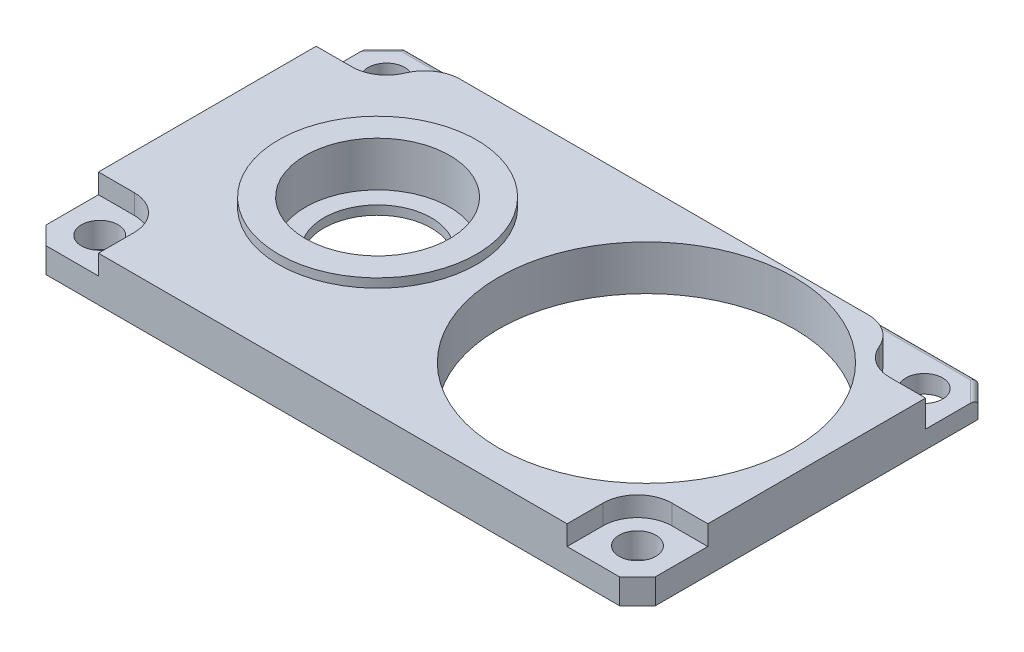
ISO-10303-21;
HEADER;
FILE_DESCRIPTION(('STEP AP214'),'2;1');
FILE_NAME('part.step','',(''),(''),'','','');
FILE_SCHEMA(('AUTOMOTIVE_DESIGN { 1 0 10303 214 1 1 1 1 }'));
ENDSEC;
DATA;
#1=APPLICATION_CONTEXT('core data for automotive mechanical design processes');
#2=APPLICATION_PROTOCOL_DEFINITION('international standard','automotive_design',2000,#1);
#3=PRODUCT_CONTEXT('',#1,'mechanical');
#4=PRODUCT('Part','Part','',(#3));
#5=PRODUCT_RELATED_PRODUCT_CATEGORY('part','',(#4));
#6=PRODUCT_DEFINITION_FORMATION('','',#4);
#7=PRODUCT_DEFINITION_CONTEXT('part definition',#1,'design');
#8=PRODUCT_DEFINITION('design','',#6,#7);
#9=PRODUCT_DEFINITION_SHAPE('','',#8);
#10=(LENGTH_UNIT() NAMED_UNIT(*) SI_UNIT(.MILLI.,.METRE.));
#11=(NAMED_UNIT(*) PLANE_ANGLE_UNIT() SI_UNIT($,.RADIAN.));
#12=(NAMED_UNIT(*) SI_UNIT($,.STERADIAN.) SOLID_ANGLE_UNIT());
#13=UNCERTAINTY_MEASURE_WITH_UNIT(LENGTH_MEASURE(1.E-05),#10,'distance_accuracy_value','');
#14=(GEOMETRIC_REPRESENTATION_CONTEXT(3) GLOBAL_UNCERTAINTY_ASSIGNED_CONTEXT((#13)) GLOBAL_UNIT_ASSIGNED_CONTEXT((#10,
#11,#12)) REPRESENTATION_CONTEXT('',''));
#15=CARTESIAN_POINT('',(0.,0.,0.));
#16=DIRECTION('',(0.,0.,1.));
#17=DIRECTION('',(1.,0.,0.));
#18=AXIS2_PLACEMENT_3D('',#15,#16,#17);
#19=CARTESIAN_POINT('',(15.,1.,8.));
#20=DIRECTION('',(0.,1.,0.));
#21=DIRECTION('',(0.,0.,1.));
#22=AXIS2_PLACEMENT_3D('',#19,#20,#21);
#23=CYLINDRICAL_SURFACE('',#22,1.925);
#24=DIRECTION('',(0.,1.,0.));
#25=VECTOR('',#24,1.);
#26=CARTESIAN_POINT('',(13.075,-4.5507882323144,8.));
#27=LINE('',#26,#25);
#28=CARTESIAN_POINT('',(13.075,1.4,8.));
#29=VERTEX_POINT('',#28);
#30=CARTESIAN_POINT('',(13.075,2.5,8.));
#31=VERTEX_POINT('',#30);
#32=EDGE_CURVE('E260',#29,#31,#27,.T.);
#33=ORIENTED_EDGE('',*,*,#32,.F.);
#34=CARTESIAN_POINT('',(15.,1.4,8.));
#35=DIRECTION('',(0.,1.,0.));
#36=DIRECTION('',(0.,0.,1.));
#37=AXIS2_PLACEMENT_3D('',#34,#35,#36);
#38=CIRCLE('',#37,1.92499999999999);
#39=CARTESIAN_POINT('',(15.,1.4,6.07500000000001));
#40=VERTEX_POINT('',#39);
#41=EDGE_CURVE('E547',#40,#29,#38,.T.);
#42=ORIENTED_EDGE('',*,*,#41,.F.);
#43=DIRECTION('',(0.,1.,0.));
#44=VECTOR('',#43,1.);
#45=CARTESIAN_POINT('',(15.,-4.5507882323144,6.07500000000001));
#46=LINE('',#45,#44);
#47=CARTESIAN_POINT('',(15.,2.5,6.07500000000001));
#48=VERTEX_POINT('',#47);
#49=EDGE_CURVE('E261',#40,#48,#46,.T.);
#50=ORIENTED_EDGE('',*,*,#49,.T.);
#51=CARTESIAN_POINT('',(15.,2.5,8.));
#52=DIRECTION('',(0.,1.,0.));
#53=DIRECTION('',(0.,0.,1.));
#54=AXIS2_PLACEMENT_3D('',#51,#52,#53);
#55=CIRCLE('',#54,1.925);
#56=EDGE_CURVE('E305',#48,#31,#55,.T.);
#57=ORIENTED_EDGE('',*,*,#56,.T.);
#58=EDGE_LOOP('',(#33,#42,#50,#57));
#59=FACE_BOUND('',#58,.T.);
#60=ADVANCED_FACE('F47',(#59),#23,.F.);
#61=CARTESIAN_POINT('',(-15.,1.,8.));
#62=DIRECTION('',(0.,1.,0.));
#63=DIRECTION('',(0.,0.,1.));
#64=AXIS2_PLACEMENT_3D('',#61,#62,#63);
#65=CYLINDRICAL_SURFACE('',#64,1.925);
#66=DIRECTION('',(0.,1.,0.));
#67=VECTOR('',#66,1.);
#68=CARTESIAN_POINT('',(-15.,-4.5507882323144,6.075));
#69=LINE('',#68,#67);
#70=CARTESIAN_POINT('',(-15.,1.4,6.075));
#71=VERTEX_POINT('',#70);
#72=CARTESIAN_POINT('',(-15.,2.5,6.075));
#73=VERTEX_POINT('',#72);
#74=EDGE_CURVE('E236',#71,#73,#69,.T.);
#75=ORIENTED_EDGE('',*,*,#74,.F.);
#76=CARTESIAN_POINT('',(-15.,1.4,8.));
#77=DIRECTION('',(0.,1.,0.));
#78=DIRECTION('',(0.,0.,1.));
#79=AXIS2_PLACEMENT_3D('',#76,#77,#78);
#80=CIRCLE('',#79,1.925);
#81=CARTESIAN_POINT('',(-13.075,1.4,8.00000000000001));
#82=VERTEX_POINT('',#81);
#83=EDGE_CURVE('E220',#82,#71,#80,.T.);
#84=ORIENTED_EDGE('',*,*,#83,.F.);
#85=DIRECTION('',(0.,1.,0.));
#86=VECTOR('',#85,1.);
#87=CARTESIAN_POINT('',(-13.075,-4.5507882323144,8.00000000000001));
#88=LINE('',#87,#86);
#89=CARTESIAN_POINT('',(-13.075,2.5,8.00000000000001));
#90=VERTEX_POINT('',#89);
#91=EDGE_CURVE('E272',#82,#90,#88,.T.);
#92=ORIENTED_EDGE('',*,*,#91,.T.);
#93=CARTESIAN_POINT('',(-15.,2.5,8.));
#94=DIRECTION('',(0.,1.,0.));
#95=DIRECTION('',(0.,0.,1.));
#96=AXIS2_PLACEMENT_3D('',#93,#94,#95);
#97=CIRCLE('',#96,1.925);
#98=EDGE_CURVE('E243',#90,#73,#97,.T.);
#99=ORIENTED_EDGE('',*,*,#98,.T.);
#100=EDGE_LOOP('',(#75,#84,#92,#99));
#101=FACE_BOUND('',#100,.T.);
#102=ADVANCED_FACE('F241',(#101),#65,.F.);
#103=CARTESIAN_POINT('',(17.,2.5,8.99999999999999));
#104=DIRECTION('',(-0.707106781186546,0.,-0.707106781186549));
#105=DIRECTION('',(0.,-1.,0.));
#106=AXIS2_PLACEMENT_3D('',#103,#104,#105);
#107=PLANE('',#106);
#108=DIRECTION('',(0.,-1.,0.));
#109=VECTOR('',#108,1.);
#110=CARTESIAN_POINT('',(17.,2.5,8.99999999999999));
#111=LINE('',#110,#109);
#112=CARTESIAN_POINT('',(17.,1.4,9.));
#113=VERTEX_POINT('',#112);
#114=CARTESIAN_POINT('',(17.,0.,8.99999999999999));
#115=VERTEX_POINT('',#114);
#116=EDGE_CURVE('E400',#113,#115,#111,.T.);
#117=ORIENTED_EDGE('',*,*,#116,.F.);
#118=DIRECTION('',(0.707106781186549,0.,-0.707106781186546));
#119=VECTOR('',#118,1.);
#120=CARTESIAN_POINT('',(16.,1.4,10.));
#121=LINE('',#120,#119);
#122=CARTESIAN_POINT('',(16.,1.4,10.));
#123=VERTEX_POINT('',#122);
#124=EDGE_CURVE('E529',#123,#113,#121,.T.);
#125=ORIENTED_EDGE('',*,*,#124,.F.);
#126=DIRECTION('',(0.,1.,0.));
#127=VECTOR('',#126,1.);
#128=CARTESIAN_POINT('',(16.,2.5,10.));
#129=LINE('',#128,#127);
#130=CARTESIAN_POINT('',(16.,0.,10.));
#131=VERTEX_POINT('',#130);
#132=EDGE_CURVE('E412',#131,#123,#129,.T.);
#133=ORIENTED_EDGE('',*,*,#132,.F.);
#134=DIRECTION('',(0.707106781186549,0.,-0.707106781186546));
#135=VECTOR('',#134,1.);
#136=CARTESIAN_POINT('',(17.,0.,8.99999999999999));
#137=LINE('',#136,#135);
#138=EDGE_CURVE('E408',#115,#131,#137,.F.);
#139=ORIENTED_EDGE('',*,*,#138,.F.);
#140=EDGE_LOOP('',(#117,#125,#133,#139));
#141=FACE_BOUND('',#140,.T.);
#142=ADVANCED_FACE('F562',(#141),#107,.F.);
#143=CARTESIAN_POINT('',(-16.,2.5,10.));
#144=DIRECTION('',(0.707106781186549,0.,-0.707106781186546));
#145=DIRECTION('',(0.,-1.,0.));
#146=AXIS2_PLACEMENT_3D('',#143,#144,#145);
#147=PLANE('',#146);
#148=DIRECTION('',(0.,-1.,0.));
#149=VECTOR('',#148,1.);
#150=CARTESIAN_POINT('',(-16.,2.5,10.));
#151=LINE('',#150,#149);
#152=CARTESIAN_POINT('',(-16.,1.4,10.));
#153=VERTEX_POINT('',#152);
#154=CARTESIAN_POINT('',(-16.,0.,10.));
#155=VERTEX_POINT('',#154);
#156=EDGE_CURVE('E410',#153,#155,#151,.T.);
#157=ORIENTED_EDGE('',*,*,#156,.F.);
#158=DIRECTION('',(0.707106781186546,0.,0.707106781186549));
#159=VECTOR('',#158,1.);
#160=CARTESIAN_POINT('',(-17.,1.4,8.99999999999999));
#161=LINE('',#160,#159);
#162=CARTESIAN_POINT('',(-17.,1.4,8.99999999999999));
#163=VERTEX_POINT('',#162);
#164=EDGE_CURVE('E569',#163,#153,#161,.T.);
#165=ORIENTED_EDGE('',*,*,#164,.F.);
#166=DIRECTION('',(0.,1.,0.));
#167=VECTOR('',#166,1.);
#168=CARTESIAN_POINT('',(-17.,2.5,8.99999999999999));
#169=LINE('',#168,#167);
#170=CARTESIAN_POINT('',(-17.,0.,8.99999999999999));
#171=VERTEX_POINT('',#170);
#172=EDGE_CURVE('E416',#171,#163,#169,.T.);
#173=ORIENTED_EDGE('',*,*,#172,.F.);
#174=DIRECTION('',(0.707106781186546,0.,0.707106781186549));
#175=VECTOR('',#174,1.);
#176=CARTESIAN_POINT('',(-16.,0.,10.));
#177=LINE('',#176,#175);
#178=EDGE_CURVE('E406',#155,#171,#177,.F.);
#179=ORIENTED_EDGE('',*,*,#178,.F.);
#180=EDGE_LOOP('',(#157,#165,#173,#179));
#181=FACE_BOUND('',#180,.T.);
#182=ADVANCED_FACE('F567',(#181),#147,.F.);
#183=CARTESIAN_POINT('',(0.,2.5,0.));
#184=DIRECTION('',(0.,1.,0.));
#185=DIRECTION('',(0.,0.,1.));
#186=AXIS2_PLACEMENT_3D('',#183,#184,#185);
#187=PLANE('',#186);
#188=DIRECTION('',(0.,0.,-1.));
#189=VECTOR('',#188,1.);
#190=CARTESIAN_POINT('',(-13.075,2.5,10.));
#191=LINE('',#190,#189);
#192=CARTESIAN_POINT('',(-13.075,2.5,10.));
#193=VERTEX_POINT('',#192);
#194=EDGE_CURVE('E244',#193,#90,#191,.T.);
#195=ORIENTED_EDGE('',*,*,#194,.F.);
#196=DIRECTION('',(1.,0.,0.));
#197=VECTOR('',#196,1.);
#198=CARTESIAN_POINT('',(-17.,2.5,10.));
#199=LINE('',#198,#197);
#200=CARTESIAN_POINT('',(13.075,2.5,9.99999999999999));
#201=VERTEX_POINT('',#200);
#202=EDGE_CURVE('E342',#193,#201,#199,.T.);
#203=ORIENTED_EDGE('',*,*,#202,.T.);
#204=DIRECTION('',(0.,0.,1.));
#205=VECTOR('',#204,1.);
#206=CARTESIAN_POINT('',(13.075,2.5,9.99999999999999));
#207=LINE('',#206,#205);
#208=EDGE_CURVE('E253',#31,#201,#207,.T.);
#209=ORIENTED_EDGE('',*,*,#208,.F.);
#210=ORIENTED_EDGE('',*,*,#56,.F.);
#211=DIRECTION('',(-1.,0.,0.));
#212=VECTOR('',#211,1.);
#213=CARTESIAN_POINT('',(15.,2.5,6.07500000000001));
#214=LINE('',#213,#212);
#215=CARTESIAN_POINT('',(17.,2.5,6.07500000000002));
#216=VERTEX_POINT('',#215);
#217=EDGE_CURVE('E256',#216,#48,#214,.T.);
#218=ORIENTED_EDGE('',*,*,#217,.F.);
#219=DIRECTION('',(0.,0.,-1.));
#220=VECTOR('',#219,1.);
#221=CARTESIAN_POINT('',(17.,2.5,-10.));
#222=LINE('',#221,#220);
#223=CARTESIAN_POINT('',(17.,2.5,-6.075));
#224=VERTEX_POINT('',#223);
#225=EDGE_CURVE('E336',#216,#224,#222,.T.);
#226=ORIENTED_EDGE('',*,*,#225,.T.);
#227=DIRECTION('',(1.,0.,0.));
#228=VECTOR('',#227,1.);
#229=CARTESIAN_POINT('',(15.,2.5,-6.075));
#230=LINE('',#229,#228);
#231=CARTESIAN_POINT('',(15.,2.5,-6.075));
#232=VERTEX_POINT('',#231);
#233=EDGE_CURVE('E282',#232,#224,#230,.T.);
#234=ORIENTED_EDGE('',*,*,#233,.F.);
#235=CARTESIAN_POINT('',(15.,2.5,-8.));
#236=DIRECTION('',(0.,1.,0.));
#237=DIRECTION('',(0.,0.,1.));
#238=AXIS2_PLACEMENT_3D('',#235,#236,#237);
#239=CIRCLE('',#238,1.925);
#240=CARTESIAN_POINT('',(13.2211193317985,2.5,-7.26433121019109));
#241=VERTEX_POINT('',#240);
#242=EDGE_CURVE('E315',#241,#232,#239,.T.);
#243=ORIENTED_EDGE('',*,*,#242,.F.);
#244=CARTESIAN_POINT('',(11.3729316245761,2.5,-6.5));
#245=DIRECTION('',(0.,1.,0.));
#246=DIRECTION('',(0.,0.,1.));
#247=AXIS2_PLACEMENT_3D('',#244,#245,#246);
#248=CIRCLE('',#247,2.);
#249=CARTESIAN_POINT('',(11.3729316245761,2.5,-8.5));
#250=VERTEX_POINT('',#249);
#251=EDGE_CURVE('E384',#241,#250,#248,.T.);
#252=ORIENTED_EDGE('',*,*,#251,.T.);
#253=DIRECTION('',(1.,0.,0.));
#254=VECTOR('',#253,1.);
#255=CARTESIAN_POINT('',(13.1410688554979,2.5,-8.5));
#256=LINE('',#255,#254);
#257=CARTESIAN_POINT('',(-11.3729316245761,2.5,-8.5));
#258=VERTEX_POINT('',#257);
#259=EDGE_CURVE('E297',#258,#250,#256,.T.);
#260=ORIENTED_EDGE('',*,*,#259,.F.);
#261=CARTESIAN_POINT('',(-11.3729316245761,2.5,-6.5));
#262=DIRECTION('',(0.,1.,0.));
#263=DIRECTION('',(0.,0.,1.));
#264=AXIS2_PLACEMENT_3D('',#261,#262,#263);
#265=CIRCLE('',#264,2.);
#266=CARTESIAN_POINT('',(-13.2211193317985,2.5,-7.26433121019108));
#267=VERTEX_POINT('',#266);
#268=EDGE_CURVE('E386',#258,#267,#265,.T.);
#269=ORIENTED_EDGE('',*,*,#268,.T.);
#270=CARTESIAN_POINT('',(-15.,2.5,-8.));
#271=DIRECTION('',(0.,1.,0.));
#272=DIRECTION('',(0.,0.,1.));
#273=AXIS2_PLACEMENT_3D('',#270,#271,#272);
#274=CIRCLE('',#273,1.925);
#275=CARTESIAN_POINT('',(-15.,2.5,-6.075));
#276=VERTEX_POINT('',#275);
#277=EDGE_CURVE('E317',#276,#267,#274,.T.);
#278=ORIENTED_EDGE('',*,*,#277,.F.);
#279=DIRECTION('',(1.,0.,0.));
#280=VECTOR('',#279,1.);
#281=CARTESIAN_POINT('',(-15.,2.5,-6.075));
#282=LINE('',#281,#280);
#283=CARTESIAN_POINT('',(-17.,2.5,-6.075));
#284=VERTEX_POINT('',#283);
#285=EDGE_CURVE('E295',#284,#276,#282,.T.);
#286=ORIENTED_EDGE('',*,*,#285,.F.);
#287=DIRECTION('',(0.,0.,1.));
#288=VECTOR('',#287,1.);
#289=CARTESIAN_POINT('',(-17.,2.5,-10.));
#290=LINE('',#289,#288);
#291=CARTESIAN_POINT('',(-17.,2.5,6.075));
#292=VERTEX_POINT('',#291);
#293=EDGE_CURVE('E338',#284,#292,#290,.T.);
#294=ORIENTED_EDGE('',*,*,#293,.T.);
#295=DIRECTION('',(-1.,0.,0.));
#296=VECTOR('',#295,1.);
#297=CARTESIAN_POINT('',(-15.,2.5,6.075));
#298=LINE('',#297,#296);
#299=EDGE_CURVE('E249',#73,#292,#298,.T.);
#300=ORIENTED_EDGE('',*,*,#299,.F.);
#301=ORIENTED_EDGE('',*,*,#98,.F.);
#302=EDGE_LOOP('',(#195,#203,#209,#210,#218,#226,#234,#243,#252,#260,#269,#278,#286,#294,#300,#301));
#303=FACE_BOUND('',#302,.T.);
#304=CARTESIAN_POINT('',(7.5,2.5,0.));
#305=DIRECTION('',(0.,1.,0.));
#306=DIRECTION('',(0.,0.,1.));
#307=AXIS2_PLACEMENT_3D('',#304,#305,#306);
#308=CIRCLE('',#307,8.25);
#309=CARTESIAN_POINT('',(7.5,2.5,8.25));
#310=VERTEX_POINT('',#309);
#311=EDGE_CURVE('E332',#310,#310,#308,.T.);
#312=ORIENTED_EDGE('',*,*,#311,.F.);
#313=EDGE_LOOP('',(#312));
#314=FACE_BOUND('',#313,.T.);
#315=CARTESIAN_POINT('',(-7.5,2.5,0.));
#316=DIRECTION('',(0.,1.,0.));
#317=DIRECTION('',(0.,0.,1.));
#318=AXIS2_PLACEMENT_3D('',#315,#316,#317);
#319=CIRCLE('',#318,5.525);
#320=CARTESIAN_POINT('',(-7.5,2.5,5.525));
#321=VERTEX_POINT('',#320);
#322=EDGE_CURVE('E271',#321,#321,#319,.T.);
#323=ORIENTED_EDGE('',*,*,#322,.F.);
#324=EDGE_LOOP('',(#323));
#325=FACE_BOUND('',#324,.T.);
#326=ADVANCED_FACE('F489',(#303,#314,#325),#187,.T.);
#327=CARTESIAN_POINT('',(15.,-1.5,-8.));
#328=DIRECTION('',(0.,1.,0.));
#329=DIRECTION('',(0.,0.,1.));
#330=AXIS2_PLACEMENT_3D('',#327,#328,#329);
#331=CYLINDRICAL_SURFACE('',#330,1.025);
#332=CARTESIAN_POINT('',(15.,0.,-8.));
#333=DIRECTION('',(0.,1.,0.));
#334=DIRECTION('',(0.,0.,1.));
#335=AXIS2_PLACEMENT_3D('',#332,#333,#334);
#336=CIRCLE('',#335,1.025);
#337=CARTESIAN_POINT('',(15.,0.,-6.97500000000001));
#338=VERTEX_POINT('',#337);
#339=EDGE_CURVE('E364',#338,#338,#336,.T.);
#340=ORIENTED_EDGE('',*,*,#339,.F.);
#341=EDGE_LOOP('',(#340));
#342=FACE_BOUND('',#341,.T.);
#343=CARTESIAN_POINT('',(15.,1.,-8.));
#344=DIRECTION('',(0.,1.,0.));
#345=DIRECTION('',(0.,0.,1.));
#346=AXIS2_PLACEMENT_3D('',#343,#344,#345);
#347=CIRCLE('',#346,1.025);
#348=CARTESIAN_POINT('',(15.,1.,-6.97500000000001));
#349=VERTEX_POINT('',#348);
#350=EDGE_CURVE('E368',#349,#349,#347,.F.);
#351=ORIENTED_EDGE('',*,*,#350,.F.);
#352=EDGE_LOOP('',(#351));
#353=FACE_BOUND('',#352,.T.);
#354=ADVANCED_FACE('F605',(#342,#353),#331,.F.);
#355=CARTESIAN_POINT('',(-15.,-1.5,-8.));
#356=DIRECTION('',(0.,1.,0.));
#357=DIRECTION('',(0.,0.,1.));
#358=AXIS2_PLACEMENT_3D('',#355,#356,#357);
#359=CYLINDRICAL_SURFACE('',#358,1.025);
#360=CARTESIAN_POINT('',(-15.,0.,-8.));
#361=DIRECTION('',(0.,1.,0.));
#362=DIRECTION('',(0.,0.,1.));
#363=AXIS2_PLACEMENT_3D('',#360,#361,#362);
#364=CIRCLE('',#363,1.025);
#365=CARTESIAN_POINT('',(-15.,0.,-6.975));
#366=VERTEX_POINT('',#365);
#367=EDGE_CURVE('E367',#366,#366,#364,.T.);
#368=ORIENTED_EDGE('',*,*,#367,.F.);
#369=EDGE_LOOP('',(#368));
#370=FACE_BOUND('',#369,.T.);
#371=CARTESIAN_POINT('',(-15.,1.,-8.));
#372=DIRECTION('',(0.,1.,0.));
#373=DIRECTION('',(0.,0.,1.));
#374=AXIS2_PLACEMENT_3D('',#371,#372,#373);
#375=CIRCLE('',#374,1.025);
#376=CARTESIAN_POINT('',(-15.,1.,-6.975));
#377=VERTEX_POINT('',#376);
#378=EDGE_CURVE('E324',#377,#377,#375,.F.);
#379=ORIENTED_EDGE('',*,*,#378,.F.);
#380=EDGE_LOOP('',(#379));
#381=FACE_BOUND('',#380,.T.);
#382=ADVANCED_FACE('F602',(#370,#381),#359,.F.);
#383=CARTESIAN_POINT('',(-15.,-1.5,8.));
#384=DIRECTION('',(0.,1.,0.));
#385=DIRECTION('',(0.,0.,1.));
#386=AXIS2_PLACEMENT_3D('',#383,#384,#385);
#387=CYLINDRICAL_SURFACE('',#386,1.025);
#388=CARTESIAN_POINT('',(-15.,0.,8.));
#389=DIRECTION('',(0.,1.,0.));
#390=DIRECTION('',(0.,0.,1.));
#391=AXIS2_PLACEMENT_3D('',#388,#389,#390);
#392=CIRCLE('',#391,1.025);
#393=CARTESIAN_POINT('',(-15.,0.,9.025));
#394=VERTEX_POINT('',#393);
#395=EDGE_CURVE('E371',#394,#394,#392,.T.);
#396=ORIENTED_EDGE('',*,*,#395,.F.);
#397=EDGE_LOOP('',(#396));
#398=FACE_BOUND('',#397,.T.);
#399=CARTESIAN_POINT('',(-15.,1.4,8.));
#400=DIRECTION('',(0.,1.,0.));
#401=DIRECTION('',(0.,0.,1.));
#402=AXIS2_PLACEMENT_3D('',#399,#400,#401);
#403=CIRCLE('',#402,1.025);
#404=CARTESIAN_POINT('',(-15.,1.4,9.025));
#405=VERTEX_POINT('',#404);
#406=EDGE_CURVE('E231',#405,#405,#403,.T.);
#407=ORIENTED_EDGE('',*,*,#406,.T.);
#408=EDGE_LOOP('',(#407));
#409=FACE_BOUND('',#408,.T.);
#410=ADVANCED_FACE('F578',(#398,#409),#387,.F.);
#411=CARTESIAN_POINT('',(15.,-1.5,8.));
#412=DIRECTION('',(0.,1.,0.));
#413=DIRECTION('',(0.,0.,1.));
#414=AXIS2_PLACEMENT_3D('',#411,#412,#413);
#415=CYLINDRICAL_SURFACE('',#414,1.025);
#416=CARTESIAN_POINT('',(15.,0.,8.));
#417=DIRECTION('',(0.,1.,0.));
#418=DIRECTION('',(0.,0.,1.));
#419=AXIS2_PLACEMENT_3D('',#416,#417,#418);
#420=CIRCLE('',#419,1.025);
#421=CARTESIAN_POINT('',(15.,0.,9.025));
#422=VERTEX_POINT('',#421);
#423=EDGE_CURVE('E331',#422,#422,#420,.T.);
#424=ORIENTED_EDGE('',*,*,#423,.F.);
#425=EDGE_LOOP('',(#424));
#426=FACE_BOUND('',#425,.T.);
#427=CARTESIAN_POINT('',(15.,1.4,8.));
#428=DIRECTION('',(0.,1.,0.));
#429=DIRECTION('',(0.,0.,1.));
#430=AXIS2_PLACEMENT_3D('',#427,#428,#429);
#431=CIRCLE('',#430,1.025);
#432=CARTESIAN_POINT('',(15.,1.4,9.025));
#433=VERTEX_POINT('',#432);
#434=EDGE_CURVE('E549',#433,#433,#431,.T.);
#435=ORIENTED_EDGE('',*,*,#434,.T.);
#436=EDGE_LOOP('',(#435));
#437=FACE_BOUND('',#436,.T.);
#438=ADVANCED_FACE('F609',(#426,#437),#415,.F.);
#439=CARTESIAN_POINT('',(-7.5,-2.5,0.));
#440=DIRECTION('',(0.,1.,0.));
#441=DIRECTION('',(0.,0.,1.));
#442=AXIS2_PLACEMENT_3D('',#439,#440,#441);
#443=CYLINDRICAL_SURFACE('',#442,3.);
#444=CARTESIAN_POINT('',(-7.5,0.,0.));
#445=DIRECTION('',(0.,1.,0.));
#446=DIRECTION('',(0.,0.,1.));
#447=AXIS2_PLACEMENT_3D('',#444,#445,#446);
#448=CIRCLE('',#447,3.);
#449=CARTESIAN_POINT('',(-7.5,0.,3.));
#450=VERTEX_POINT('',#449);
#451=EDGE_CURVE('E350',#450,#450,#448,.T.);
#452=ORIENTED_EDGE('',*,*,#451,.F.);
#453=EDGE_LOOP('',(#452));
#454=FACE_BOUND('',#453,.T.);
#455=CARTESIAN_POINT('',(-7.5,0.5,0.));
#456=DIRECTION('',(0.,1.,0.));
#457=DIRECTION('',(0.,0.,1.));
#458=AXIS2_PLACEMENT_3D('',#455,#456,#457);
#459=CIRCLE('',#458,3.);
#460=CARTESIAN_POINT('',(-7.5,0.5,3.));
#461=VERTEX_POINT('',#460);
#462=EDGE_CURVE('E330',#461,#461,#459,.F.);
#463=ORIENTED_EDGE('',*,*,#462,.F.);
#464=EDGE_LOOP('',(#463));
#465=FACE_BOUND('',#464,.T.);
#466=ADVANCED_FACE('F613',(#454,#465),#443,.F.);
#467=CARTESIAN_POINT('',(17.,2.5,-10.));
#468=DIRECTION('',(-1.,0.,0.));
#469=DIRECTION('',(0.,0.,1.));
#470=AXIS2_PLACEMENT_3D('',#467,#468,#469);
#471=PLANE('',#470);
#472=DIRECTION('',(0.,0.,-1.));
#473=VECTOR('',#472,1.);
#474=CARTESIAN_POINT('',(17.,1.4,9.));
#475=LINE('',#474,#473);
#476=CARTESIAN_POINT('',(17.,1.4,6.07500000000002));
#477=VERTEX_POINT('',#476);
#478=EDGE_CURVE('E521',#113,#477,#475,.T.);
#479=ORIENTED_EDGE('',*,*,#478,.F.);
#480=ORIENTED_EDGE('',*,*,#116,.T.);
#481=DIRECTION('',(0.,0.,-1.));
#482=VECTOR('',#481,1.);
#483=CARTESIAN_POINT('',(17.,0.,-10.));
#484=LINE('',#483,#482);
#485=CARTESIAN_POINT('',(17.,0.,-8.99999999999999));
#486=VERTEX_POINT('',#485);
#487=EDGE_CURVE('E346',#115,#486,#484,.T.);
#488=ORIENTED_EDGE('',*,*,#487,.T.);
#489=DIRECTION('',(0.,1.,0.));
#490=VECTOR('',#489,1.);
#491=CARTESIAN_POINT('',(17.,2.5,-8.99999999999999));
#492=LINE('',#491,#490);
#493=CARTESIAN_POINT('',(17.,0.7,-8.99999999999999));
#494=VERTEX_POINT('',#493);
#495=EDGE_CURVE('E397',#486,#494,#492,.T.);
#496=ORIENTED_EDGE('',*,*,#495,.T.);
#497=CARTESIAN_POINT('',(17.,0.7,-8.57573593128806));
#498=DIRECTION('',(-1.,0.,0.));
#499=DIRECTION('',(0.,0.,1.));
#500=AXIS2_PLACEMENT_3D('',#497,#498,#499);
#501=ELLIPSE('',#500,0.42426406871193,0.3);
#502=CARTESIAN_POINT('',(17.,1.,-8.57573593128806));
#503=VERTEX_POINT('',#502);
#504=EDGE_CURVE('E56',#494,#503,#501,.F.);
#505=ORIENTED_EDGE('',*,*,#504,.T.);
#506=DIRECTION('',(0.,0.,-1.));
#507=VECTOR('',#506,1.);
#508=CARTESIAN_POINT('',(17.,1.,-6.075));
#509=LINE('',#508,#507);
#510=CARTESIAN_POINT('',(17.,1.,-6.075));
#511=VERTEX_POINT('',#510);
#512=EDGE_CURVE('E291',#511,#503,#509,.T.);
#513=ORIENTED_EDGE('',*,*,#512,.F.);
#514=DIRECTION('',(0.,1.,0.));
#515=VECTOR('',#514,1.);
#516=CARTESIAN_POINT('',(17.,1.,-6.075));
#517=LINE('',#516,#515);
#518=EDGE_CURVE('E302',#511,#224,#517,.T.);
#519=ORIENTED_EDGE('',*,*,#518,.T.);
#520=ORIENTED_EDGE('',*,*,#225,.F.);
#521=DIRECTION('',(0.,1.,0.));
#522=VECTOR('',#521,1.);
#523=CARTESIAN_POINT('',(17.,-4.5507882323144,6.07500000000002));
#524=LINE('',#523,#522);
#525=EDGE_CURVE('E263',#477,#216,#524,.T.);
#526=ORIENTED_EDGE('',*,*,#525,.F.);
#527=EDGE_LOOP('',(#479,#480,#488,#496,#505,#513,#519,#520,#526));
#528=FACE_BOUND('',#527,.T.);
#529=ADVANCED_FACE('F458',(#528),#471,.F.);
#530=CARTESIAN_POINT('',(-17.,2.5,-10.));
#531=DIRECTION('',(0.,0.,1.));
#532=DIRECTION('',(1.,0.,0.));
#533=AXIS2_PLACEMENT_3D('',#530,#531,#532);
#534=PLANE('',#533);
#535=DIRECTION('',(0.,1.,0.));
#536=VECTOR('',#535,1.);
#537=CARTESIAN_POINT('',(-16.,2.5,-10.));
#538=LINE('',#537,#536);
#539=CARTESIAN_POINT('',(-16.,0.,-10.));
#540=VERTEX_POINT('',#539);
#541=CARTESIAN_POINT('',(-16.,0.7,-10.));
#542=VERTEX_POINT('',#541);
#543=EDGE_CURVE('E420',#540,#542,#538,.T.);
#544=ORIENTED_EDGE('',*,*,#543,.T.);
#545=DIRECTION('',(-1.,0.,0.));
#546=VECTOR('',#545,1.);
#547=CARTESIAN_POINT('',(16.,0.7,-10.));
#548=LINE('',#547,#546);
#549=CARTESIAN_POINT('',(16.,0.7,-10.));
#550=VERTEX_POINT('',#549);
#551=EDGE_CURVE('E11',#542,#550,#548,.F.);
#552=ORIENTED_EDGE('',*,*,#551,.T.);
#553=DIRECTION('',(0.,-1.,0.));
#554=VECTOR('',#553,1.);
#555=CARTESIAN_POINT('',(16.,2.5,-10.));
#556=LINE('',#555,#554);
#557=CARTESIAN_POINT('',(16.,0.,-10.));
#558=VERTEX_POINT('',#557);
#559=EDGE_CURVE('E418',#550,#558,#556,.T.);
#560=ORIENTED_EDGE('',*,*,#559,.T.);
#561=DIRECTION('',(-1.,0.,0.));
#562=VECTOR('',#561,1.);
#563=CARTESIAN_POINT('',(-17.,0.,-10.));
#564=LINE('',#563,#562);
#565=EDGE_CURVE('E349',#558,#540,#564,.T.);
#566=ORIENTED_EDGE('',*,*,#565,.T.);
#567=EDGE_LOOP('',(#544,#552,#560,#566));
#568=FACE_BOUND('',#567,.T.);
#569=ADVANCED_FACE('F470',(#568),#534,.F.);
#570=CARTESIAN_POINT('',(-17.,2.5,-10.));
#571=DIRECTION('',(1.,0.,0.));
#572=DIRECTION('',(0.,0.,-1.));
#573=AXIS2_PLACEMENT_3D('',#570,#571,#572);
#574=PLANE('',#573);
#575=ORIENTED_EDGE('',*,*,#172,.T.);
#576=DIRECTION('',(0.,0.,1.));
#577=VECTOR('',#576,1.);
#578=CARTESIAN_POINT('',(-17.,1.4,6.075));
#579=LINE('',#578,#577);
#580=CARTESIAN_POINT('',(-17.,1.4,6.075));
#581=VERTEX_POINT('',#580);
#582=EDGE_CURVE('E64',#581,#163,#579,.T.);
#583=ORIENTED_EDGE('',*,*,#582,.F.);
#584=DIRECTION('',(0.,1.,0.));
#585=VECTOR('',#584,1.);
#586=CARTESIAN_POINT('',(-17.,-4.5507882323144,6.075));
#587=LINE('',#586,#585);
#588=EDGE_CURVE('E238',#581,#292,#587,.T.);
#589=ORIENTED_EDGE('',*,*,#588,.T.);
#590=ORIENTED_EDGE('',*,*,#293,.F.);
#591=DIRECTION('',(0.,1.,0.));
#592=VECTOR('',#591,1.);
#593=CARTESIAN_POINT('',(-17.,1.,-6.075));
#594=LINE('',#593,#592);
#595=CARTESIAN_POINT('',(-17.,1.,-6.075));
#596=VERTEX_POINT('',#595);
#597=EDGE_CURVE('E294',#596,#284,#594,.T.);
#598=ORIENTED_EDGE('',*,*,#597,.F.);
#599=DIRECTION('',(0.,0.,1.));
#600=VECTOR('',#599,1.);
#601=CARTESIAN_POINT('',(-17.,1.,-6.075));
#602=LINE('',#601,#600);
#603=CARTESIAN_POINT('',(-17.,1.,-8.57573593128807));
#604=VERTEX_POINT('',#603);
#605=EDGE_CURVE('E279',#604,#596,#602,.T.);
#606=ORIENTED_EDGE('',*,*,#605,.F.);
#607=CARTESIAN_POINT('',(-17.,0.7,-8.57573593128807));
#608=DIRECTION('',(1.,0.,0.));
#609=DIRECTION('',(0.,0.,-1.));
#610=AXIS2_PLACEMENT_3D('',#607,#608,#609);
#611=ELLIPSE('',#610,0.424264068711928,0.3);
#612=CARTESIAN_POINT('',(-17.,0.7,-9.00000000000001));
#613=VERTEX_POINT('',#612);
#614=EDGE_CURVE('E430',#604,#613,#611,.F.);
#615=ORIENTED_EDGE('',*,*,#614,.T.);
#616=DIRECTION('',(0.,-1.,0.));
#617=VECTOR('',#616,1.);
#618=CARTESIAN_POINT('',(-17.,2.5,-9.00000000000001));
#619=LINE('',#618,#617);
#620=CARTESIAN_POINT('',(-17.,0.,-9.00000000000001));
#621=VERTEX_POINT('',#620);
#622=EDGE_CURVE('E414',#613,#621,#619,.T.);
#623=ORIENTED_EDGE('',*,*,#622,.T.);
#624=DIRECTION('',(0.,0.,1.));
#625=VECTOR('',#624,1.);
#626=CARTESIAN_POINT('',(-17.,0.,-10.));
#627=LINE('',#626,#625);
#628=EDGE_CURVE('E353',#621,#171,#627,.T.);
#629=ORIENTED_EDGE('',*,*,#628,.T.);
#630=EDGE_LOOP('',(#575,#583,#589,#590,#598,#606,#615,#623,#629));
#631=FACE_BOUND('',#630,.T.);
#632=ADVANCED_FACE('F481',(#631),#574,.F.);
#633=CARTESIAN_POINT('',(-17.,2.5,10.));
#634=DIRECTION('',(0.,0.,-1.));
#635=DIRECTION('',(-1.,0.,0.));
#636=AXIS2_PLACEMENT_3D('',#633,#634,#635);
#637=PLANE('',#636);
#638=DIRECTION('',(1.,0.,0.));
#639=VECTOR('',#638,1.);
#640=CARTESIAN_POINT('',(-16.,1.4,10.));
#641=LINE('',#640,#639);
#642=CARTESIAN_POINT('',(-13.075,1.4,10.));
#643=VERTEX_POINT('',#642);
#644=EDGE_CURVE('E570',#153,#643,#641,.T.);
#645=ORIENTED_EDGE('',*,*,#644,.F.);
#646=ORIENTED_EDGE('',*,*,#156,.T.);
#647=DIRECTION('',(1.,0.,0.));
#648=VECTOR('',#647,1.);
#649=CARTESIAN_POINT('',(-17.,0.,10.));
#650=LINE('',#649,#648);
#651=EDGE_CURVE('E339',#155,#131,#650,.T.);
#652=ORIENTED_EDGE('',*,*,#651,.T.);
#653=ORIENTED_EDGE('',*,*,#132,.T.);
#654=DIRECTION('',(1.,0.,0.));
#655=VECTOR('',#654,1.);
#656=CARTESIAN_POINT('',(13.075,1.4,9.99999999999999));
#657=LINE('',#656,#655);
#658=CARTESIAN_POINT('',(13.075,1.4,9.99999999999999));
#659=VERTEX_POINT('',#658);
#660=EDGE_CURVE('E72',#659,#123,#657,.T.);
#661=ORIENTED_EDGE('',*,*,#660,.F.);
#662=DIRECTION('',(0.,1.,0.));
#663=VECTOR('',#662,1.);
#664=CARTESIAN_POINT('',(13.075,-4.5507882323144,9.99999999999999));
#665=LINE('',#664,#663);
#666=EDGE_CURVE('E265',#659,#201,#665,.T.);
#667=ORIENTED_EDGE('',*,*,#666,.T.);
#668=ORIENTED_EDGE('',*,*,#202,.F.);
#669=DIRECTION('',(0.,1.,0.));
#670=VECTOR('',#669,1.);
#671=CARTESIAN_POINT('',(-13.075,-4.5507882323144,10.));
#672=LINE('',#671,#670);
#673=EDGE_CURVE('E246',#643,#193,#672,.T.);
#674=ORIENTED_EDGE('',*,*,#673,.F.);
#675=EDGE_LOOP('',(#645,#646,#652,#653,#661,#667,#668,#674));
#676=FACE_BOUND('',#675,.T.);
#677=ADVANCED_FACE('F540',(#676),#637,.F.);
#678=CARTESIAN_POINT('',(0.,0.,0.));
#679=DIRECTION('',(0.,1.,0.));
#680=DIRECTION('',(0.,0.,1.));
#681=AXIS2_PLACEMENT_3D('',#678,#679,#680);
#682=PLANE('',#681);
#683=ORIENTED_EDGE('',*,*,#423,.T.);
#684=EDGE_LOOP('',(#683));
#685=FACE_BOUND('',#684,.T.);
#686=ORIENTED_EDGE('',*,*,#395,.T.);
#687=EDGE_LOOP('',(#686));
#688=FACE_BOUND('',#687,.T.);
#689=ORIENTED_EDGE('',*,*,#367,.T.);
#690=EDGE_LOOP('',(#689));
#691=FACE_BOUND('',#690,.T.);
#692=ORIENTED_EDGE('',*,*,#339,.T.);
#693=EDGE_LOOP('',(#692));
#694=FACE_BOUND('',#693,.T.);
#695=ORIENTED_EDGE('',*,*,#451,.T.);
#696=EDGE_LOOP('',(#695));
#697=FACE_BOUND('',#696,.T.);
#698=CARTESIAN_POINT('',(7.5,0.,0.));
#699=DIRECTION('',(0.,1.,0.));
#700=DIRECTION('',(0.,0.,1.));
#701=AXIS2_PLACEMENT_3D('',#698,#699,#700);
#702=CIRCLE('',#701,8.25);
#703=CARTESIAN_POINT('',(7.5,0.,8.25));
#704=VERTEX_POINT('',#703);
#705=EDGE_CURVE('E335',#704,#704,#702,.T.);
#706=ORIENTED_EDGE('',*,*,#705,.T.);
#707=EDGE_LOOP('',(#706));
#708=FACE_BOUND('',#707,.T.);
#709=ORIENTED_EDGE('',*,*,#487,.F.);
#710=ORIENTED_EDGE('',*,*,#138,.T.);
#711=ORIENTED_EDGE('',*,*,#651,.F.);
#712=ORIENTED_EDGE('',*,*,#178,.T.);
#713=ORIENTED_EDGE('',*,*,#628,.F.);
#714=DIRECTION('',(-0.707106781186549,0.,0.707106781186546));
#715=VECTOR('',#714,1.);
#716=CARTESIAN_POINT('',(-17.,0.,-9.00000000000001));
#717=LINE('',#716,#715);
#718=EDGE_CURVE('E404',#621,#540,#717,.F.);
#719=ORIENTED_EDGE('',*,*,#718,.T.);
#720=ORIENTED_EDGE('',*,*,#565,.F.);
#721=DIRECTION('',(-0.707106781186545,0.,-0.70710678118655));
#722=VECTOR('',#721,1.);
#723=CARTESIAN_POINT('',(16.,0.,-10.));
#724=LINE('',#723,#722);
#725=EDGE_CURVE('E402',#558,#486,#724,.F.);
#726=ORIENTED_EDGE('',*,*,#725,.T.);
#727=EDGE_LOOP('',(#709,#710,#711,#712,#713,#719,#720,#726));
#728=FACE_BOUND('',#727,.T.);
#729=ADVANCED_FACE('F463',(#685,#688,#691,#694,#697,#708,#728),#682,.F.);
#730=CARTESIAN_POINT('',(7.5,-2.5,0.));
#731=DIRECTION('',(0.,1.,0.));
#732=DIRECTION('',(0.,0.,1.));
#733=AXIS2_PLACEMENT_3D('',#730,#731,#732);
#734=CYLINDRICAL_SURFACE('',#733,8.25);
#735=ORIENTED_EDGE('',*,*,#311,.T.);
#736=EDGE_LOOP('',(#735));
#737=FACE_BOUND('',#736,.T.);
#738=ORIENTED_EDGE('',*,*,#705,.F.);
#739=EDGE_LOOP('',(#738));
#740=FACE_BOUND('',#739,.T.);
#741=ADVANCED_FACE('F621',(#737,#740),#734,.F.);
#742=CARTESIAN_POINT('',(-7.5,0.5,0.));
#743=DIRECTION('',(0.,1.,0.));
#744=DIRECTION('',(0.,0.,1.));
#745=AXIS2_PLACEMENT_3D('',#742,#743,#744);
#746=PLANE('',#745);
#747=CARTESIAN_POINT('',(-7.5,0.5,0.));
#748=DIRECTION('',(0.,1.,0.));
#749=DIRECTION('',(0.,0.,1.));
#750=AXIS2_PLACEMENT_3D('',#747,#748,#749);
#751=CIRCLE('',#750,4.025);
#752=CARTESIAN_POINT('',(-7.5,0.5,4.025));
#753=VERTEX_POINT('',#752);
#754=EDGE_CURVE('E327',#753,#753,#751,.T.);
#755=ORIENTED_EDGE('',*,*,#754,.T.);
#756=EDGE_LOOP('',(#755));
#757=FACE_BOUND('',#756,.T.);
#758=ORIENTED_EDGE('',*,*,#462,.T.);
#759=EDGE_LOOP('',(#758));
#760=FACE_BOUND('',#759,.T.);
#761=ADVANCED_FACE('F618',(#757,#760),#746,.T.);
#762=CARTESIAN_POINT('',(-7.5,0.5,0.));
#763=DIRECTION('',(0.,1.,0.));
#764=DIRECTION('',(0.,0.,1.));
#765=AXIS2_PLACEMENT_3D('',#762,#763,#764);
#766=CYLINDRICAL_SURFACE('',#765,4.025);
#767=ORIENTED_EDGE('',*,*,#754,.F.);
#768=EDGE_LOOP('',(#767));
#769=FACE_BOUND('',#768,.T.);
#770=CARTESIAN_POINT('',(-7.5,3.,0.));
#771=DIRECTION('',(0.,1.,0.));
#772=DIRECTION('',(0.,0.,1.));
#773=AXIS2_PLACEMENT_3D('',#770,#771,#772);
#774=CIRCLE('',#773,4.025);
#775=CARTESIAN_POINT('',(-7.5,3.,4.025));
#776=VERTEX_POINT('',#775);
#777=EDGE_CURVE('E268',#776,#776,#774,.T.);
#778=ORIENTED_EDGE('',*,*,#777,.T.);
#779=EDGE_LOOP('',(#778));
#780=FACE_BOUND('',#779,.T.);
#781=ADVANCED_FACE('F601',(#769,#780),#766,.F.);
#782=CARTESIAN_POINT('',(-15.,1.,-8.));
#783=DIRECTION('',(0.,1.,0.));
#784=DIRECTION('',(0.,0.,1.));
#785=AXIS2_PLACEMENT_3D('',#782,#783,#784);
#786=CYLINDRICAL_SURFACE('',#785,1.925);
#787=ORIENTED_EDGE('',*,*,#277,.T.);
#788=DIRECTION('',(0.,1.,0.));
#789=VECTOR('',#788,1.);
#790=CARTESIAN_POINT('',(-13.2211193317985,1.,-7.26433121019108));
#791=LINE('',#790,#789);
#792=CARTESIAN_POINT('',(-13.2211193317985,1.,-7.26433121019108));
#793=VERTEX_POINT('',#792);
#794=EDGE_CURVE('E388',#267,#793,#791,.F.);
#795=ORIENTED_EDGE('',*,*,#794,.T.);
#796=CARTESIAN_POINT('',(-15.,1.,-8.));
#797=DIRECTION('',(0.,1.,0.));
#798=DIRECTION('',(0.,0.,1.));
#799=AXIS2_PLACEMENT_3D('',#796,#797,#798);
#800=CIRCLE('',#799,1.925);
#801=CARTESIAN_POINT('',(-15.,1.,-6.075));
#802=VERTEX_POINT('',#801);
#803=EDGE_CURVE('E321',#802,#793,#800,.T.);
#804=ORIENTED_EDGE('',*,*,#803,.F.);
#805=DIRECTION('',(0.,1.,0.));
#806=VECTOR('',#805,1.);
#807=CARTESIAN_POINT('',(-15.,1.,-6.075));
#808=LINE('',#807,#806);
#809=EDGE_CURVE('E309',#802,#276,#808,.T.);
#810=ORIENTED_EDGE('',*,*,#809,.T.);
#811=EDGE_LOOP('',(#787,#795,#804,#810));
#812=FACE_BOUND('',#811,.T.);
#813=ADVANCED_FACE('F494',(#812),#786,.F.);
#814=CARTESIAN_POINT('',(15.,1.,-8.));
#815=DIRECTION('',(0.,1.,0.));
#816=DIRECTION('',(0.,0.,1.));
#817=AXIS2_PLACEMENT_3D('',#814,#815,#816);
#818=PLANE('',#817);
#819=DIRECTION('',(-1.,0.,0.));
#820=VECTOR('',#819,1.);
#821=CARTESIAN_POINT('',(-16.,1.,-9.7));
#822=LINE('',#821,#820);
#823=CARTESIAN_POINT('',(15.8757359312881,1.,-9.7));
#824=VERTEX_POINT('',#823);
#825=CARTESIAN_POINT('',(-15.8757359312881,1.,-9.7));
#826=VERTEX_POINT('',#825);
#827=EDGE_CURVE('E423',#824,#826,#822,.T.);
#828=ORIENTED_EDGE('',*,*,#827,.T.);
#829=DIRECTION('',(0.707106781186549,0.,-0.707106781186546));
#830=VECTOR('',#829,1.);
#831=CARTESIAN_POINT('',(-1.28786796564398,1.,-24.287867965644));
#832=LINE('',#831,#830);
#833=EDGE_CURVE('E427',#826,#604,#832,.F.);
#834=ORIENTED_EDGE('',*,*,#833,.T.);
#835=ORIENTED_EDGE('',*,*,#605,.T.);
#836=DIRECTION('',(1.,0.,0.));
#837=VECTOR('',#836,1.);
#838=CARTESIAN_POINT('',(-15.,1.,-6.075));
#839=LINE('',#838,#837);
#840=EDGE_CURVE('E281',#596,#802,#839,.T.);
#841=ORIENTED_EDGE('',*,*,#840,.T.);
#842=ORIENTED_EDGE('',*,*,#803,.T.);
#843=CARTESIAN_POINT('',(-11.3729316245761,1.,-6.5));
#844=DIRECTION('',(0.,1.,0.));
#845=DIRECTION('',(0.,0.,1.));
#846=AXIS2_PLACEMENT_3D('',#843,#844,#845);
#847=CIRCLE('',#846,2.);
#848=CARTESIAN_POINT('',(-11.3729316245761,1.,-8.5));
#849=VERTEX_POINT('',#848);
#850=EDGE_CURVE('E393',#793,#849,#847,.F.);
#851=ORIENTED_EDGE('',*,*,#850,.T.);
#852=DIRECTION('',(1.,0.,0.));
#853=VECTOR('',#852,1.);
#854=CARTESIAN_POINT('',(13.1410688554979,1.,-8.5));
#855=LINE('',#854,#853);
#856=CARTESIAN_POINT('',(11.3729316245761,1.,-8.5));
#857=VERTEX_POINT('',#856);
#858=EDGE_CURVE('E285',#849,#857,#855,.T.);
#859=ORIENTED_EDGE('',*,*,#858,.T.);
#860=CARTESIAN_POINT('',(11.3729316245761,1.,-6.5));
#861=DIRECTION('',(0.,1.,0.));
#862=DIRECTION('',(0.,0.,1.));
#863=AXIS2_PLACEMENT_3D('',#860,#861,#862);
#864=CIRCLE('',#863,2.);
#865=CARTESIAN_POINT('',(13.2211193317985,1.,-7.26433121019109));
#866=VERTEX_POINT('',#865);
#867=EDGE_CURVE('E395',#857,#866,#864,.F.);
#868=ORIENTED_EDGE('',*,*,#867,.T.);
#869=CARTESIAN_POINT('',(15.,1.,-8.));
#870=DIRECTION('',(0.,1.,0.));
#871=DIRECTION('',(0.,0.,1.));
#872=AXIS2_PLACEMENT_3D('',#869,#870,#871);
#873=CIRCLE('',#872,1.925);
#874=CARTESIAN_POINT('',(15.,1.,-6.075));
#875=VERTEX_POINT('',#874);
#876=EDGE_CURVE('E318',#866,#875,#873,.T.);
#877=ORIENTED_EDGE('',*,*,#876,.T.);
#878=DIRECTION('',(1.,0.,0.));
#879=VECTOR('',#878,1.);
#880=CARTESIAN_POINT('',(15.,1.,-6.075));
#881=LINE('',#880,#879);
#882=EDGE_CURVE('E288',#875,#511,#881,.T.);
#883=ORIENTED_EDGE('',*,*,#882,.T.);
#884=ORIENTED_EDGE('',*,*,#512,.T.);
#885=DIRECTION('',(0.707106781186545,0.,0.70710678118655));
#886=VECTOR('',#885,1.);
#887=CARTESIAN_POINT('',(16.287867965644,1.,-9.28786796564403));
#888=LINE('',#887,#886);
#889=EDGE_CURVE('E425',#503,#824,#888,.F.);
#890=ORIENTED_EDGE('',*,*,#889,.T.);
#891=EDGE_LOOP('',(#828,#834,#835,#841,#842,#851,#859,#868,#877,#883,#884,#890));
#892=FACE_BOUND('',#891,.T.);
#893=ORIENTED_EDGE('',*,*,#350,.T.);
#894=EDGE_LOOP('',(#893));
#895=FACE_BOUND('',#894,.T.);
#896=ORIENTED_EDGE('',*,*,#378,.T.);
#897=EDGE_LOOP('',(#896));
#898=FACE_BOUND('',#897,.T.);
#899=ADVANCED_FACE('F477',(#892,#895,#898),#818,.T.);
#900=CARTESIAN_POINT('',(15.,1.,-8.));
#901=DIRECTION('',(0.,1.,0.));
#902=DIRECTION('',(0.,0.,1.));
#903=AXIS2_PLACEMENT_3D('',#900,#901,#902);
#904=CYLINDRICAL_SURFACE('',#903,1.925);
#905=ORIENTED_EDGE('',*,*,#876,.F.);
#906=DIRECTION('',(0.,1.,0.));
#907=VECTOR('',#906,1.);
#908=CARTESIAN_POINT('',(13.2211193317985,1.,-7.26433121019109));
#909=LINE('',#908,#907);
#910=EDGE_CURVE('E390',#866,#241,#909,.T.);
#911=ORIENTED_EDGE('',*,*,#910,.T.);
#912=ORIENTED_EDGE('',*,*,#242,.T.);
#913=DIRECTION('',(0.,1.,0.));
#914=VECTOR('',#913,1.);
#915=CARTESIAN_POINT('',(15.,1.,-6.075));
#916=LINE('',#915,#914);
#917=EDGE_CURVE('E306',#875,#232,#916,.T.);
#918=ORIENTED_EDGE('',*,*,#917,.F.);
#919=EDGE_LOOP('',(#905,#911,#912,#918));
#920=FACE_BOUND('',#919,.T.);
#921=ADVANCED_FACE('F512',(#920),#904,.F.);
#922=CARTESIAN_POINT('',(15.,1.,-6.075));
#923=DIRECTION('',(0.,0.,1.));
#924=DIRECTION('',(1.,0.,0.));
#925=AXIS2_PLACEMENT_3D('',#922,#923,#924);
#926=PLANE('',#925);
#927=ORIENTED_EDGE('',*,*,#233,.T.);
#928=ORIENTED_EDGE('',*,*,#518,.F.);
#929=ORIENTED_EDGE('',*,*,#882,.F.);
#930=ORIENTED_EDGE('',*,*,#917,.T.);
#931=EDGE_LOOP('',(#927,#928,#929,#930));
#932=FACE_BOUND('',#931,.T.);
#933=ADVANCED_FACE('F516',(#932),#926,.F.);
#934=CARTESIAN_POINT('',(13.1410688554979,1.,-8.5));
#935=DIRECTION('',(0.,0.,1.));
#936=DIRECTION('',(1.,0.,0.));
#937=AXIS2_PLACEMENT_3D('',#934,#935,#936);
#938=PLANE('',#937);
#939=ORIENTED_EDGE('',*,*,#858,.F.);
#940=DIRECTION('',(0.,1.,0.));
#941=VECTOR('',#940,1.);
#942=CARTESIAN_POINT('',(-11.3729316245761,1.,-8.5));
#943=LINE('',#942,#941);
#944=EDGE_CURVE('E381',#849,#258,#943,.T.);
#945=ORIENTED_EDGE('',*,*,#944,.T.);
#946=ORIENTED_EDGE('',*,*,#259,.T.);
#947=DIRECTION('',(0.,1.,0.));
#948=VECTOR('',#947,1.);
#949=CARTESIAN_POINT('',(11.3729316245761,1.,-8.5));
#950=LINE('',#949,#948);
#951=EDGE_CURVE('E345',#250,#857,#950,.F.);
#952=ORIENTED_EDGE('',*,*,#951,.T.);
#953=EDGE_LOOP('',(#939,#945,#946,#952));
#954=FACE_BOUND('',#953,.T.);
#955=ADVANCED_FACE('F503',(#954),#938,.F.);
#956=CARTESIAN_POINT('',(-15.,1.,-6.075));
#957=DIRECTION('',(0.,0.,1.));
#958=DIRECTION('',(1.,0.,0.));
#959=AXIS2_PLACEMENT_3D('',#956,#957,#958);
#960=PLANE('',#959);
#961=ORIENTED_EDGE('',*,*,#285,.T.);
#962=ORIENTED_EDGE('',*,*,#809,.F.);
#963=ORIENTED_EDGE('',*,*,#840,.F.);
#964=ORIENTED_EDGE('',*,*,#597,.T.);
#965=EDGE_LOOP('',(#961,#962,#963,#964));
#966=FACE_BOUND('',#965,.T.);
#967=ADVANCED_FACE('F485',(#966),#960,.F.);
#968=CARTESIAN_POINT('',(-11.3729316245761,1.,-6.5));
#969=DIRECTION('',(0.,1.,0.));
#970=DIRECTION('',(0.,0.,1.));
#971=AXIS2_PLACEMENT_3D('',#968,#969,#970);
#972=CYLINDRICAL_SURFACE('',#971,2.);
#973=ORIENTED_EDGE('',*,*,#850,.F.);
#974=ORIENTED_EDGE('',*,*,#794,.F.);
#975=ORIENTED_EDGE('',*,*,#268,.F.);
#976=ORIENTED_EDGE('',*,*,#944,.F.);
#977=EDGE_LOOP('',(#973,#974,#975,#976));
#978=FACE_BOUND('',#977,.T.);
#979=ADVANCED_FACE('F498',(#978),#972,.T.);
#980=CARTESIAN_POINT('',(11.3729316245761,1.,-6.5));
#981=DIRECTION('',(0.,1.,0.));
#982=DIRECTION('',(0.,0.,1.));
#983=AXIS2_PLACEMENT_3D('',#980,#981,#982);
#984=CYLINDRICAL_SURFACE('',#983,2.);
#985=ORIENTED_EDGE('',*,*,#867,.F.);
#986=ORIENTED_EDGE('',*,*,#951,.F.);
#987=ORIENTED_EDGE('',*,*,#251,.F.);
#988=ORIENTED_EDGE('',*,*,#910,.F.);
#989=EDGE_LOOP('',(#985,#986,#987,#988));
#990=FACE_BOUND('',#989,.T.);
#991=ADVANCED_FACE('F506',(#990),#984,.T.);
#992=CARTESIAN_POINT('',(-17.,2.5,-9.00000000000001));
#993=DIRECTION('',(0.707106781186546,0.,0.707106781186549));
#994=DIRECTION('',(0.,-1.,0.));
#995=AXIS2_PLACEMENT_3D('',#992,#993,#994);
#996=PLANE('',#995);
#997=ORIENTED_EDGE('',*,*,#622,.F.);
#998=DIRECTION('',(-0.707106781186549,0.,0.707106781186546));
#999=VECTOR('',#998,1.);
#1000=CARTESIAN_POINT('',(-17.,0.7,-9.00000000000001));
#1001=LINE('',#1000,#999);
#1002=EDGE_CURVE('E432',#613,#542,#1001,.F.);
#1003=ORIENTED_EDGE('',*,*,#1002,.T.);
#1004=ORIENTED_EDGE('',*,*,#543,.F.);
#1005=ORIENTED_EDGE('',*,*,#718,.F.);
#1006=EDGE_LOOP('',(#997,#1003,#1004,#1005));
#1007=FACE_BOUND('',#1006,.T.);
#1008=ADVANCED_FACE('F473',(#1007),#996,.F.);
#1009=CARTESIAN_POINT('',(16.,2.5,-10.));
#1010=DIRECTION('',(-0.70710678118655,0.,0.707106781186545));
#1011=DIRECTION('',(0.,-1.,0.));
#1012=AXIS2_PLACEMENT_3D('',#1009,#1010,#1011);
#1013=PLANE('',#1012);
#1014=ORIENTED_EDGE('',*,*,#559,.F.);
#1015=DIRECTION('',(-0.707106781186545,0.,-0.70710678118655));
#1016=VECTOR('',#1015,1.);
#1017=CARTESIAN_POINT('',(16.,0.7,-10.));
#1018=LINE('',#1017,#1016);
#1019=EDGE_CURVE('E434',#550,#494,#1018,.F.);
#1020=ORIENTED_EDGE('',*,*,#1019,.T.);
#1021=ORIENTED_EDGE('',*,*,#495,.F.);
#1022=ORIENTED_EDGE('',*,*,#725,.F.);
#1023=EDGE_LOOP('',(#1014,#1020,#1021,#1022));
#1024=FACE_BOUND('',#1023,.T.);
#1025=ADVANCED_FACE('F454',(#1024),#1013,.F.);
#1026=CARTESIAN_POINT('',(16.287867965644,0.7,-9.28786796564403));
#1027=DIRECTION('',(0.707106781186545,0.,0.70710678118655));
#1028=DIRECTION('',(0.70710678118655,0.,-0.707106781186545));
#1029=AXIS2_PLACEMENT_3D('',#1026,#1027,#1028);
#1030=CYLINDRICAL_SURFACE('',#1029,0.3);
#1031=ORIENTED_EDGE('',*,*,#504,.F.);
#1032=ORIENTED_EDGE('',*,*,#1019,.F.);
#1033=CARTESIAN_POINT('',(15.8757359312881,0.7,-9.7));
#1034=DIRECTION('',(0.923879532511286,0.,0.382683432365091));
#1035=DIRECTION('',(0.382683432365091,0.,-0.923879532511286));
#1036=AXIS2_PLACEMENT_3D('',#1033,#1034,#1035);
#1037=ELLIPSE('',#1036,0.324717660087718,0.3);
#1038=EDGE_CURVE('E51',#824,#550,#1037,.F.);
#1039=ORIENTED_EDGE('',*,*,#1038,.F.);
#1040=ORIENTED_EDGE('',*,*,#889,.F.);
#1041=EDGE_LOOP('',(#1031,#1032,#1039,#1040));
#1042=FACE_BOUND('',#1041,.T.);
#1043=ADVANCED_FACE('F49',(#1042),#1030,.T.);
#1044=CARTESIAN_POINT('',(15.,0.7,-9.7));
#1045=DIRECTION('',(1.,0.,0.));
#1046=DIRECTION('',(0.,0.,-1.));
#1047=AXIS2_PLACEMENT_3D('',#1044,#1045,#1046);
#1048=CYLINDRICAL_SURFACE('',#1047,0.3);
#1049=ORIENTED_EDGE('',*,*,#1038,.T.);
#1050=ORIENTED_EDGE('',*,*,#551,.F.);
#1051=CARTESIAN_POINT('',(-15.8757359312881,0.7,-9.7));
#1052=DIRECTION('',(0.923879532511287,0.,-0.382683432365089));
#1053=DIRECTION('',(0.382683432365089,0.,0.923879532511287));
#1054=AXIS2_PLACEMENT_3D('',#1051,#1052,#1053);
#1055=ELLIPSE('',#1054,0.324717660087718,0.3);
#1056=EDGE_CURVE('E276',#826,#542,#1055,.F.);
#1057=ORIENTED_EDGE('',*,*,#1056,.F.);
#1058=ORIENTED_EDGE('',*,*,#827,.F.);
#1059=EDGE_LOOP('',(#1049,#1050,#1057,#1058));
#1060=FACE_BOUND('',#1059,.T.);
#1061=ADVANCED_FACE('F446',(#1060),#1048,.T.);
#1062=CARTESIAN_POINT('',(-1.28786796564398,0.7,-24.287867965644));
#1063=DIRECTION('',(0.707106781186549,0.,-0.707106781186546));
#1064=DIRECTION('',(-0.707106781186546,0.,-0.707106781186549));
#1065=AXIS2_PLACEMENT_3D('',#1062,#1063,#1064);
#1066=CYLINDRICAL_SURFACE('',#1065,0.3);
#1067=ORIENTED_EDGE('',*,*,#1056,.T.);
#1068=ORIENTED_EDGE('',*,*,#1002,.F.);
#1069=ORIENTED_EDGE('',*,*,#614,.F.);
#1070=ORIENTED_EDGE('',*,*,#833,.F.);
#1071=EDGE_LOOP('',(#1067,#1068,#1069,#1070));
#1072=FACE_BOUND('',#1071,.T.);
#1073=ADVANCED_FACE('F474',(#1072),#1066,.T.);
#1074=CARTESIAN_POINT('',(-7.5,3.,0.));
#1075=DIRECTION('',(0.,1.,0.));
#1076=DIRECTION('',(0.,0.,1.));
#1077=AXIS2_PLACEMENT_3D('',#1074,#1075,#1076);
#1078=PLANE('',#1077);
#1079=CARTESIAN_POINT('',(-7.5,3.,0.));
#1080=DIRECTION('',(0.,1.,0.));
#1081=DIRECTION('',(0.,0.,1.));
#1082=AXIS2_PLACEMENT_3D('',#1079,#1080,#1081);
#1083=CIRCLE('',#1082,5.525);
#1084=CARTESIAN_POINT('',(-7.5,3.,5.525));
#1085=VERTEX_POINT('',#1084);
#1086=EDGE_CURVE('E273',#1085,#1085,#1083,.T.);
#1087=ORIENTED_EDGE('',*,*,#1086,.T.);
#1088=EDGE_LOOP('',(#1087));
#1089=FACE_BOUND('',#1088,.T.);
#1090=ORIENTED_EDGE('',*,*,#777,.F.);
#1091=EDGE_LOOP('',(#1090));
#1092=FACE_BOUND('',#1091,.T.);
#1093=ADVANCED_FACE('F669',(#1089,#1092),#1078,.T.);
#1094=CARTESIAN_POINT('',(-7.5,3.,0.));
#1095=DIRECTION('',(0.,-1.,0.));
#1096=DIRECTION('',(0.,0.,-1.));
#1097=AXIS2_PLACEMENT_3D('',#1094,#1095,#1096);
#1098=CYLINDRICAL_SURFACE('',#1097,5.525);
#1099=ORIENTED_EDGE('',*,*,#1086,.F.);
#1100=EDGE_LOOP('',(#1099));
#1101=FACE_BOUND('',#1100,.T.);
#1102=ORIENTED_EDGE('',*,*,#322,.T.);
#1103=EDGE_LOOP('',(#1102));
#1104=FACE_BOUND('',#1103,.T.);
#1105=ADVANCED_FACE('F815',(#1101,#1104),#1098,.T.);
#1106=CARTESIAN_POINT('',(-13.075,-4.5507882323144,10.));
#1107=DIRECTION('',(1.,0.,0.));
#1108=DIRECTION('',(0.,0.,-1.));
#1109=AXIS2_PLACEMENT_3D('',#1106,#1107,#1108);
#1110=PLANE('',#1109);
#1111=ORIENTED_EDGE('',*,*,#91,.F.);
#1112=DIRECTION('',(0.,0.,-1.));
#1113=VECTOR('',#1112,1.);
#1114=CARTESIAN_POINT('',(-13.075,1.4,10.));
#1115=LINE('',#1114,#1113);
#1116=EDGE_CURVE('E227',#643,#82,#1115,.T.);
#1117=ORIENTED_EDGE('',*,*,#1116,.F.);
#1118=ORIENTED_EDGE('',*,*,#673,.T.);
#1119=ORIENTED_EDGE('',*,*,#194,.T.);
#1120=EDGE_LOOP('',(#1111,#1117,#1118,#1119));
#1121=FACE_BOUND('',#1120,.T.);
#1122=ADVANCED_FACE('F536',(#1121),#1110,.F.);
#1123=CARTESIAN_POINT('',(-15.,-4.5507882323144,6.075));
#1124=DIRECTION('',(0.,0.,-1.));
#1125=DIRECTION('',(-1.,0.,0.));
#1126=AXIS2_PLACEMENT_3D('',#1123,#1124,#1125);
#1127=PLANE('',#1126);
#1128=ORIENTED_EDGE('',*,*,#588,.F.);
#1129=DIRECTION('',(-1.,0.,0.));
#1130=VECTOR('',#1129,1.);
#1131=CARTESIAN_POINT('',(-15.,1.4,6.075));
#1132=LINE('',#1131,#1130);
#1133=EDGE_CURVE('E224',#71,#581,#1132,.T.);
#1134=ORIENTED_EDGE('',*,*,#1133,.F.);
#1135=ORIENTED_EDGE('',*,*,#74,.T.);
#1136=ORIENTED_EDGE('',*,*,#299,.T.);
#1137=EDGE_LOOP('',(#1128,#1134,#1135,#1136));
#1138=FACE_BOUND('',#1137,.T.);
#1139=ADVANCED_FACE('F234',(#1138),#1127,.F.);
#1140=CARTESIAN_POINT('',(15.,-4.5507882323144,6.07500000000001));
#1141=DIRECTION('',(0.,0.,-1.));
#1142=DIRECTION('',(-1.,0.,0.));
#1143=AXIS2_PLACEMENT_3D('',#1140,#1141,#1142);
#1144=PLANE('',#1143);
#1145=ORIENTED_EDGE('',*,*,#49,.F.);
#1146=DIRECTION('',(-1.,0.,0.));
#1147=VECTOR('',#1146,1.);
#1148=CARTESIAN_POINT('',(17.,1.4,6.07500000000002));
#1149=LINE('',#1148,#1147);
#1150=EDGE_CURVE('E257',#477,#40,#1149,.T.);
#1151=ORIENTED_EDGE('',*,*,#1150,.F.);
#1152=ORIENTED_EDGE('',*,*,#525,.T.);
#1153=ORIENTED_EDGE('',*,*,#217,.T.);
#1154=EDGE_LOOP('',(#1145,#1151,#1152,#1153));
#1155=FACE_BOUND('',#1154,.T.);
#1156=ADVANCED_FACE('F525',(#1155),#1144,.F.);
#1157=CARTESIAN_POINT('',(13.075,-4.5507882323144,9.99999999999999));
#1158=DIRECTION('',(-1.,0.,0.));
#1159=DIRECTION('',(0.,0.,1.));
#1160=AXIS2_PLACEMENT_3D('',#1157,#1158,#1159);
#1161=PLANE('',#1160);
#1162=ORIENTED_EDGE('',*,*,#666,.F.);
#1163=DIRECTION('',(0.,0.,1.));
#1164=VECTOR('',#1163,1.);
#1165=CARTESIAN_POINT('',(13.075,1.4,8.));
#1166=LINE('',#1165,#1164);
#1167=EDGE_CURVE('E548',#29,#659,#1166,.T.);
#1168=ORIENTED_EDGE('',*,*,#1167,.F.);
#1169=ORIENTED_EDGE('',*,*,#32,.T.);
#1170=ORIENTED_EDGE('',*,*,#208,.T.);
#1171=EDGE_LOOP('',(#1162,#1168,#1169,#1170));
#1172=FACE_BOUND('',#1171,.T.);
#1173=ADVANCED_FACE('F544',(#1172),#1161,.F.);
#1174=CARTESIAN_POINT('',(15.,1.4,8.));
#1175=DIRECTION('',(0.,1.,0.));
#1176=DIRECTION('',(0.,0.,1.));
#1177=AXIS2_PLACEMENT_3D('',#1174,#1175,#1176);
#1178=PLANE('',#1177);
#1179=ORIENTED_EDGE('',*,*,#41,.T.);
#1180=ORIENTED_EDGE('',*,*,#1167,.T.);
#1181=ORIENTED_EDGE('',*,*,#660,.T.);
#1182=ORIENTED_EDGE('',*,*,#124,.T.);
#1183=ORIENTED_EDGE('',*,*,#478,.T.);
#1184=ORIENTED_EDGE('',*,*,#1150,.T.);
#1185=EDGE_LOOP('',(#1179,#1180,#1181,#1182,#1183,#1184));
#1186=FACE_BOUND('',#1185,.T.);
#1187=ORIENTED_EDGE('',*,*,#434,.F.);
#1188=EDGE_LOOP('',(#1187));
#1189=FACE_BOUND('',#1188,.T.);
#1190=ADVANCED_FACE('F558',(#1186,#1189),#1178,.T.);
#1191=CARTESIAN_POINT('',(-15.,1.4,8.));
#1192=DIRECTION('',(0.,1.,0.));
#1193=DIRECTION('',(0.,0.,1.));
#1194=AXIS2_PLACEMENT_3D('',#1191,#1192,#1193);
#1195=PLANE('',#1194);
#1196=ORIENTED_EDGE('',*,*,#83,.T.);
#1197=ORIENTED_EDGE('',*,*,#1133,.T.);
#1198=ORIENTED_EDGE('',*,*,#582,.T.);
#1199=ORIENTED_EDGE('',*,*,#164,.T.);
#1200=ORIENTED_EDGE('',*,*,#644,.T.);
#1201=ORIENTED_EDGE('',*,*,#1116,.T.);
#1202=EDGE_LOOP('',(#1196,#1197,#1198,#1199,#1200,#1201));
#1203=FACE_BOUND('',#1202,.T.);
#1204=ORIENTED_EDGE('',*,*,#406,.F.);
#1205=EDGE_LOOP('',(#1204));
#1206=FACE_BOUND('',#1205,.T.);
#1207=ADVANCED_FACE('F222',(#1203,#1206),#1195,.T.);
#1208=CLOSED_SHELL('',(#60,#102,#142,#182,#326,#354,#382,#410,#438,#466,#529,#569,#632,#677,
#729,#741,#761,#781,#813,#899,#921,#933,#955,#967,#979,#991,#1008,#1025,#1043,#1061,#1073,#1093,
#1105,#1122,#1139,#1156,#1173,#1190,#1207));
#1209=MANIFOLD_SOLID_BREP('B2',#1208);
#1210=ADVANCED_BREP_SHAPE_REPRESENTATION('',(#18,#1209),#14);
#1211=SHAPE_DEFINITION_REPRESENTATION(#9,#1210);
ENDSEC;
END-ISO-10303-21;
